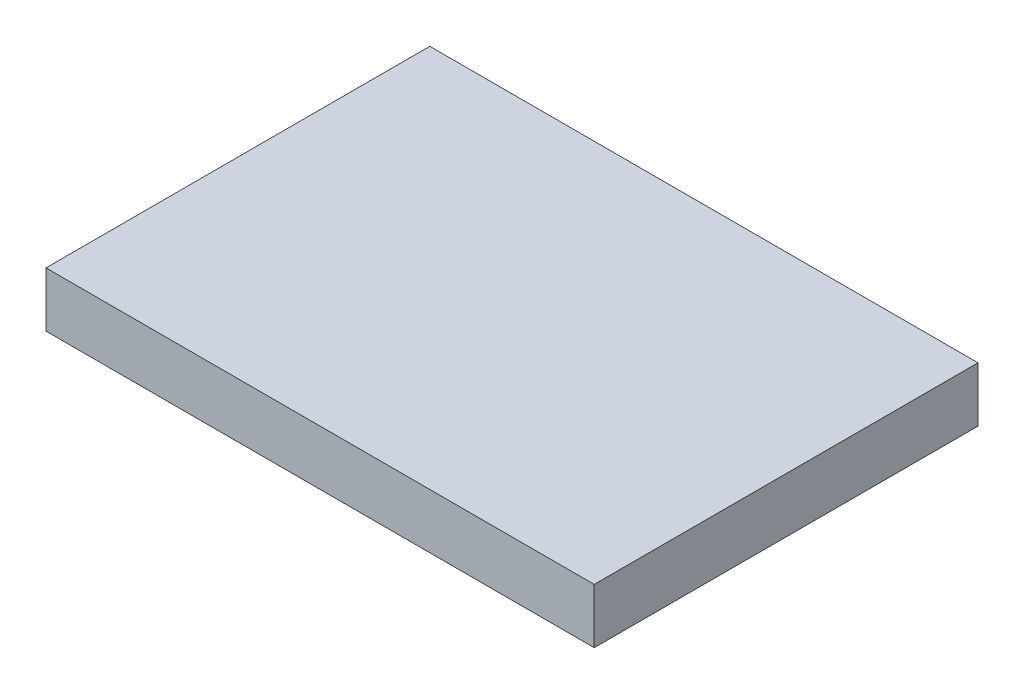
ISO-10303-21;
HEADER;
FILE_DESCRIPTION(('STEP AP214'),'2;1');
FILE_NAME('part.step','',(''),(''),'','','');
FILE_SCHEMA(('AUTOMOTIVE_DESIGN { 1 0 10303 214 1 1 1 1 }'));
ENDSEC;
DATA;
#1=APPLICATION_CONTEXT('core data for automotive mechanical design processes');
#2=APPLICATION_PROTOCOL_DEFINITION('international standard','automotive_design',2000,#1);
#3=PRODUCT_CONTEXT('',#1,'mechanical');
#4=PRODUCT('Part','Part','',(#3));
#5=PRODUCT_RELATED_PRODUCT_CATEGORY('part','',(#4));
#6=PRODUCT_DEFINITION_FORMATION('','',#4);
#7=PRODUCT_DEFINITION_CONTEXT('part definition',#1,'design');
#8=PRODUCT_DEFINITION('design','',#6,#7);
#9=PRODUCT_DEFINITION_SHAPE('','',#8);
#10=(LENGTH_UNIT() NAMED_UNIT(*) SI_UNIT(.MILLI.,.METRE.));
#11=(NAMED_UNIT(*) PLANE_ANGLE_UNIT() SI_UNIT($,.RADIAN.));
#12=(NAMED_UNIT(*) SI_UNIT($,.STERADIAN.) SOLID_ANGLE_UNIT());
#13=UNCERTAINTY_MEASURE_WITH_UNIT(LENGTH_MEASURE(1.E-05),#10,'distance_accuracy_value','');
#14=(GEOMETRIC_REPRESENTATION_CONTEXT(3) GLOBAL_UNCERTAINTY_ASSIGNED_CONTEXT((#13)) GLOBAL_UNIT_ASSIGNED_CONTEXT((#10,
#11,#12)) REPRESENTATION_CONTEXT('',''));
#15=CARTESIAN_POINT('',(0.,0.,0.));
#16=DIRECTION('',(0.,0.,1.));
#17=DIRECTION('',(1.,0.,0.));
#18=AXIS2_PLACEMENT_3D('',#15,#16,#17);
#19=CARTESIAN_POINT('',(-50.,10.,35.));
#20=DIRECTION('',(1.,0.,0.));
#21=DIRECTION('',(0.,0.,-1.));
#22=AXIS2_PLACEMENT_3D('',#19,#20,#21);
#23=PLANE('',#22);
#24=DIRECTION('',(0.,0.,1.));
#25=VECTOR('',#24,1.);
#26=CARTESIAN_POINT('',(-50.,0.,35.));
#27=LINE('',#26,#25);
#28=CARTESIAN_POINT('',(-50.,0.,-35.));
#29=VERTEX_POINT('',#28);
#30=CARTESIAN_POINT('',(-50.,0.,35.));
#31=VERTEX_POINT('',#30);
#32=EDGE_CURVE('E98',#29,#31,#27,.T.);
#33=ORIENTED_EDGE('',*,*,#32,.T.);
#34=DIRECTION('',(0.,-1.,0.));
#35=VECTOR('',#34,1.);
#36=CARTESIAN_POINT('',(-50.,10.,35.));
#37=LINE('',#36,#35);
#38=CARTESIAN_POINT('',(-50.,10.,35.));
#39=VERTEX_POINT('',#38);
#40=EDGE_CURVE('E11',#39,#31,#37,.T.);
#41=ORIENTED_EDGE('',*,*,#40,.F.);
#42=DIRECTION('',(0.,0.,1.));
#43=VECTOR('',#42,1.);
#44=CARTESIAN_POINT('',(-50.,10.,35.));
#45=LINE('',#44,#43);
#46=CARTESIAN_POINT('',(-50.,10.,-35.));
#47=VERTEX_POINT('',#46);
#48=EDGE_CURVE('E86',#47,#39,#45,.T.);
#49=ORIENTED_EDGE('',*,*,#48,.F.);
#50=DIRECTION('',(0.,-1.,0.));
#51=VECTOR('',#50,1.);
#52=CARTESIAN_POINT('',(-50.,10.,-35.));
#53=LINE('',#52,#51);
#54=EDGE_CURVE('E94',#47,#29,#53,.T.);
#55=ORIENTED_EDGE('',*,*,#54,.T.);
#56=EDGE_LOOP('',(#33,#41,#49,#55));
#57=FACE_BOUND('',#56,.T.);
#58=ADVANCED_FACE('F35',(#57),#23,.F.);
#59=CARTESIAN_POINT('',(50.,10.,35.));
#60=DIRECTION('',(0.,0.,-1.));
#61=DIRECTION('',(-1.,0.,0.));
#62=AXIS2_PLACEMENT_3D('',#59,#60,#61);
#63=PLANE('',#62);
#64=DIRECTION('',(1.,0.,0.));
#65=VECTOR('',#64,1.);
#66=CARTESIAN_POINT('',(50.,0.,35.));
#67=LINE('',#66,#65);
#68=CARTESIAN_POINT('',(50.,0.,35.));
#69=VERTEX_POINT('',#68);
#70=EDGE_CURVE('E90',#31,#69,#67,.T.);
#71=ORIENTED_EDGE('',*,*,#70,.T.);
#72=DIRECTION('',(0.,-1.,0.));
#73=VECTOR('',#72,1.);
#74=CARTESIAN_POINT('',(50.,10.,35.));
#75=LINE('',#74,#73);
#76=CARTESIAN_POINT('',(50.,10.,35.));
#77=VERTEX_POINT('',#76);
#78=EDGE_CURVE('E43',#77,#69,#75,.T.);
#79=ORIENTED_EDGE('',*,*,#78,.F.);
#80=DIRECTION('',(1.,0.,0.));
#81=VECTOR('',#80,1.);
#82=CARTESIAN_POINT('',(50.,10.,35.));
#83=LINE('',#82,#81);
#84=EDGE_CURVE('E81',#39,#77,#83,.T.);
#85=ORIENTED_EDGE('',*,*,#84,.F.);
#86=ORIENTED_EDGE('',*,*,#40,.T.);
#87=EDGE_LOOP('',(#71,#79,#85,#86));
#88=FACE_BOUND('',#87,.T.);
#89=ADVANCED_FACE('F89',(#88),#63,.F.);
#90=CARTESIAN_POINT('',(50.,10.,35.));
#91=DIRECTION('',(-1.,0.,0.));
#92=DIRECTION('',(0.,0.,1.));
#93=AXIS2_PLACEMENT_3D('',#90,#91,#92);
#94=PLANE('',#93);
#95=DIRECTION('',(0.,0.,-1.));
#96=VECTOR('',#95,1.);
#97=CARTESIAN_POINT('',(50.,0.,35.));
#98=LINE('',#97,#96);
#99=CARTESIAN_POINT('',(50.,0.,-35.));
#100=VERTEX_POINT('',#99);
#101=EDGE_CURVE('E68',#69,#100,#98,.T.);
#102=ORIENTED_EDGE('',*,*,#101,.T.);
#103=DIRECTION('',(0.,-1.,0.));
#104=VECTOR('',#103,1.);
#105=CARTESIAN_POINT('',(50.,10.,-35.));
#106=LINE('',#105,#104);
#107=CARTESIAN_POINT('',(50.,10.,-35.));
#108=VERTEX_POINT('',#107);
#109=EDGE_CURVE('E91',#108,#100,#106,.T.);
#110=ORIENTED_EDGE('',*,*,#109,.F.);
#111=DIRECTION('',(0.,0.,-1.));
#112=VECTOR('',#111,1.);
#113=CARTESIAN_POINT('',(50.,10.,35.));
#114=LINE('',#113,#112);
#115=EDGE_CURVE('E84',#77,#108,#114,.T.);
#116=ORIENTED_EDGE('',*,*,#115,.F.);
#117=ORIENTED_EDGE('',*,*,#78,.T.);
#118=EDGE_LOOP('',(#102,#110,#116,#117));
#119=FACE_BOUND('',#118,.T.);
#120=ADVANCED_FACE('F92',(#119),#94,.F.);
#121=CARTESIAN_POINT('',(50.,10.,-35.));
#122=DIRECTION('',(0.,0.,1.));
#123=DIRECTION('',(1.,0.,0.));
#124=AXIS2_PLACEMENT_3D('',#121,#122,#123);
#125=PLANE('',#124);
#126=DIRECTION('',(-1.,0.,0.));
#127=VECTOR('',#126,1.);
#128=CARTESIAN_POINT('',(50.,0.,-35.));
#129=LINE('',#128,#127);
#130=EDGE_CURVE('E74',#100,#29,#129,.T.);
#131=ORIENTED_EDGE('',*,*,#130,.T.);
#132=ORIENTED_EDGE('',*,*,#54,.F.);
#133=DIRECTION('',(-1.,0.,0.));
#134=VECTOR('',#133,1.);
#135=CARTESIAN_POINT('',(50.,10.,-35.));
#136=LINE('',#135,#134);
#137=EDGE_CURVE('E51',#108,#47,#136,.T.);
#138=ORIENTED_EDGE('',*,*,#137,.F.);
#139=ORIENTED_EDGE('',*,*,#109,.T.);
#140=EDGE_LOOP('',(#131,#132,#138,#139));
#141=FACE_BOUND('',#140,.T.);
#142=ADVANCED_FACE('F105',(#141),#125,.F.);
#143=CARTESIAN_POINT('',(0.,10.,0.));
#144=DIRECTION('',(0.,1.,0.));
#145=DIRECTION('',(0.,0.,1.));
#146=AXIS2_PLACEMENT_3D('',#143,#144,#145);
#147=PLANE('',#146);
#148=ORIENTED_EDGE('',*,*,#48,.T.);
#149=ORIENTED_EDGE('',*,*,#84,.T.);
#150=ORIENTED_EDGE('',*,*,#115,.T.);
#151=ORIENTED_EDGE('',*,*,#137,.T.);
#152=EDGE_LOOP('',(#148,#149,#150,#151));
#153=FACE_BOUND('',#152,.T.);
#154=ADVANCED_FACE('F82',(#153),#147,.T.);
#155=CARTESIAN_POINT('',(0.,0.,0.));
#156=DIRECTION('',(0.,1.,0.));
#157=DIRECTION('',(0.,0.,1.));
#158=AXIS2_PLACEMENT_3D('',#155,#156,#157);
#159=PLANE('',#158);
#160=ORIENTED_EDGE('',*,*,#32,.F.);
#161=ORIENTED_EDGE('',*,*,#130,.F.);
#162=ORIENTED_EDGE('',*,*,#101,.F.);
#163=ORIENTED_EDGE('',*,*,#70,.F.);
#164=EDGE_LOOP('',(#160,#161,#162,#163));
#165=FACE_BOUND('',#164,.T.);
#166=ADVANCED_FACE('F108',(#165),#159,.F.);
#167=CLOSED_SHELL('',(#58,#89,#120,#142,#154,#166));
#168=MANIFOLD_SOLID_BREP('B2',#167);
#169=ADVANCED_BREP_SHAPE_REPRESENTATION('',(#18,#168),#14);
#170=SHAPE_DEFINITION_REPRESENTATION(#9,#169);
ENDSEC;
END-ISO-10303-21;
